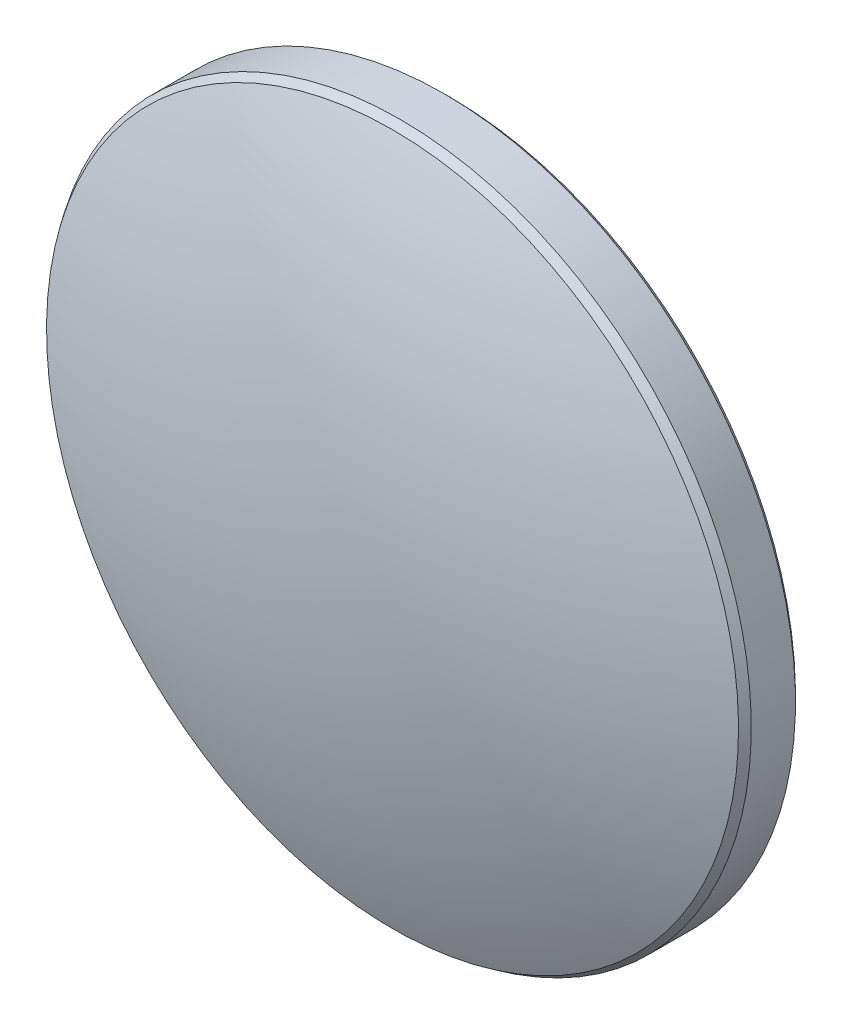
ISO-10303-21;
HEADER;
FILE_DESCRIPTION(('STEP AP214'),'2;1');
FILE_NAME('part.step','',(''),(''),'','','');
FILE_SCHEMA(('AUTOMOTIVE_DESIGN { 1 0 10303 214 1 1 1 1 }'));
ENDSEC;
DATA;
#1=APPLICATION_CONTEXT('core data for automotive mechanical design processes');
#2=APPLICATION_PROTOCOL_DEFINITION('international standard','automotive_design',2000,#1);
#3=PRODUCT_CONTEXT('',#1,'mechanical');
#4=PRODUCT('Part','Part','',(#3));
#5=PRODUCT_RELATED_PRODUCT_CATEGORY('part','',(#4));
#6=PRODUCT_DEFINITION_FORMATION('','',#4);
#7=PRODUCT_DEFINITION_CONTEXT('part definition',#1,'design');
#8=PRODUCT_DEFINITION('design','',#6,#7);
#9=PRODUCT_DEFINITION_SHAPE('','',#8);
#10=(LENGTH_UNIT() NAMED_UNIT(*) SI_UNIT(.MILLI.,.METRE.));
#11=(NAMED_UNIT(*) PLANE_ANGLE_UNIT() SI_UNIT($,.RADIAN.));
#12=(NAMED_UNIT(*) SI_UNIT($,.STERADIAN.) SOLID_ANGLE_UNIT());
#13=UNCERTAINTY_MEASURE_WITH_UNIT(LENGTH_MEASURE(1.E-05),#10,'distance_accuracy_value','');
#14=(GEOMETRIC_REPRESENTATION_CONTEXT(3) GLOBAL_UNCERTAINTY_ASSIGNED_CONTEXT((#13)) GLOBAL_UNIT_ASSIGNED_CONTEXT((#10,
#11,#12)) REPRESENTATION_CONTEXT('',''));
#15=CARTESIAN_POINT('',(0.,0.,0.));
#16=DIRECTION('',(0.,0.,1.));
#17=DIRECTION('',(1.,0.,0.));
#18=AXIS2_PLACEMENT_3D('',#15,#16,#17);
#19=CARTESIAN_POINT('',(0.,0.,-2.29));
#20=DIRECTION('',(0.,0.,-1.));
#21=DIRECTION('',(0.,1.,0.));
#22=AXIS2_PLACEMENT_3D('',#19,#20,#21);
#23=PLANE('',#22);
#24=CARTESIAN_POINT('',(0.,0.,-2.29));
#25=DIRECTION('',(0.,0.,-1.));
#26=DIRECTION('',(0.,1.,0.));
#27=AXIS2_PLACEMENT_3D('',#24,#25,#26);
#28=CIRCLE('',#27,12.5);
#29=CARTESIAN_POINT('',(0.,12.5,-2.29));
#30=VERTEX_POINT('',#29);
#31=EDGE_CURVE('E28',#30,#30,#28,.T.);
#32=ORIENTED_EDGE('',*,*,#31,.T.);
#33=EDGE_LOOP('',(#32));
#34=FACE_BOUND('',#33,.T.);
#35=ADVANCED_FACE('F13',(#34),#23,.T.);
#36=CARTESIAN_POINT('',(0.,0.,-30.2500000000001));
#37=DIRECTION('',(0.,0.,-1.));
#38=DIRECTION('',(0.,1.,0.));
#39=AXIS2_PLACEMENT_3D('',#36,#37,#38);
#40=SPHERICAL_SURFACE('',#39,32.5400000000001);
#41=CARTESIAN_POINT('',(0.,0.,-0.213529399688293));
#42=DIRECTION('',(0.,0.,-1.));
#43=DIRECTION('',(0.,1.,0.));
#44=AXIS2_PLACEMENT_3D('',#41,#42,#43);
#45=CIRCLE('',#44,12.5164705039645);
#46=CARTESIAN_POINT('',(0.,12.5164705039645,-0.21352939968829));
#47=VERTEX_POINT('',#46);
#48=EDGE_CURVE('E9',#47,#47,#45,.F.);
#49=ORIENTED_EDGE('',*,*,#48,.T.);
#50=EDGE_LOOP('',(#49));
#51=FACE_BOUND('',#50,.T.);
#52=ADVANCED_FACE('F45',(#51),#40,.T.);
#53=CARTESIAN_POINT('',(0.,0.,-2.29));
#54=DIRECTION('',(0.,0.,-1.));
#55=DIRECTION('',(0.,1.,0.));
#56=AXIS2_PLACEMENT_3D('',#53,#54,#55);
#57=CYLINDRICAL_SURFACE('',#56,12.7);
#58=CARTESIAN_POINT('',(0.,0.,-2.09000000000001));
#59=DIRECTION('',(0.,0.,-1.));
#60=DIRECTION('',(0.,1.,0.));
#61=AXIS2_PLACEMENT_3D('',#58,#59,#60);
#62=CIRCLE('',#61,12.7);
#63=CARTESIAN_POINT('',(0.,12.7,-2.09));
#64=VERTEX_POINT('',#63);
#65=EDGE_CURVE('E20',#64,#64,#62,.F.);
#66=ORIENTED_EDGE('',*,*,#65,.T.);
#67=EDGE_LOOP('',(#66));
#68=FACE_BOUND('',#67,.T.);
#69=CARTESIAN_POINT('',(0.,0.,-0.490667564179588));
#70=DIRECTION('',(0.,0.,1.));
#71=DIRECTION('',(0.,-1.,0.));
#72=AXIS2_PLACEMENT_3D('',#69,#70,#71);
#73=CIRCLE('',#72,12.7);
#74=CARTESIAN_POINT('',(0.,-12.7,-0.490667564179592));
#75=VERTEX_POINT('',#74);
#76=EDGE_CURVE('E24',#75,#75,#73,.F.);
#77=ORIENTED_EDGE('',*,*,#76,.T.);
#78=EDGE_LOOP('',(#77));
#79=FACE_BOUND('',#78,.T.);
#80=ADVANCED_FACE('F37',(#68,#79),#57,.T.);
#81=CARTESIAN_POINT('',(0.,0.,-2.29));
#82=DIRECTION('',(0.,0.,1.));
#83=DIRECTION('',(0.,-1.,0.));
#84=AXIS2_PLACEMENT_3D('',#81,#82,#83);
#85=CONICAL_SURFACE('',#84,12.5,0.785398163397444);
#86=ORIENTED_EDGE('',*,*,#65,.F.);
#87=EDGE_LOOP('',(#86));
#88=FACE_BOUND('',#87,.T.);
#89=ORIENTED_EDGE('',*,*,#31,.F.);
#90=EDGE_LOOP('',(#89));
#91=FACE_BOUND('',#90,.T.);
#92=ADVANCED_FACE('F35',(#88,#91),#85,.T.);
#93=CARTESIAN_POINT('',(0.,0.,-0.490667564179585));
#94=DIRECTION('',(0.,0.,-1.));
#95=DIRECTION('',(0.,1.,0.));
#96=AXIS2_PLACEMENT_3D('',#93,#94,#95);
#97=CONICAL_SURFACE('',#96,12.7,0.584925498145663);
#98=ORIENTED_EDGE('',*,*,#48,.F.);
#99=EDGE_LOOP('',(#98));
#100=FACE_BOUND('',#99,.T.);
#101=ORIENTED_EDGE('',*,*,#76,.F.);
#102=EDGE_LOOP('',(#101));
#103=FACE_BOUND('',#102,.T.);
#104=ADVANCED_FACE('F15',(#100,#103),#97,.T.);
#105=CLOSED_SHELL('',(#35,#52,#80,#92,#104));
#106=MANIFOLD_SOLID_BREP('B1',#105);
#107=ADVANCED_BREP_SHAPE_REPRESENTATION('',(#18,#106),#14);
#108=SHAPE_DEFINITION_REPRESENTATION(#9,#107);
ENDSEC;
END-ISO-10303-21;
